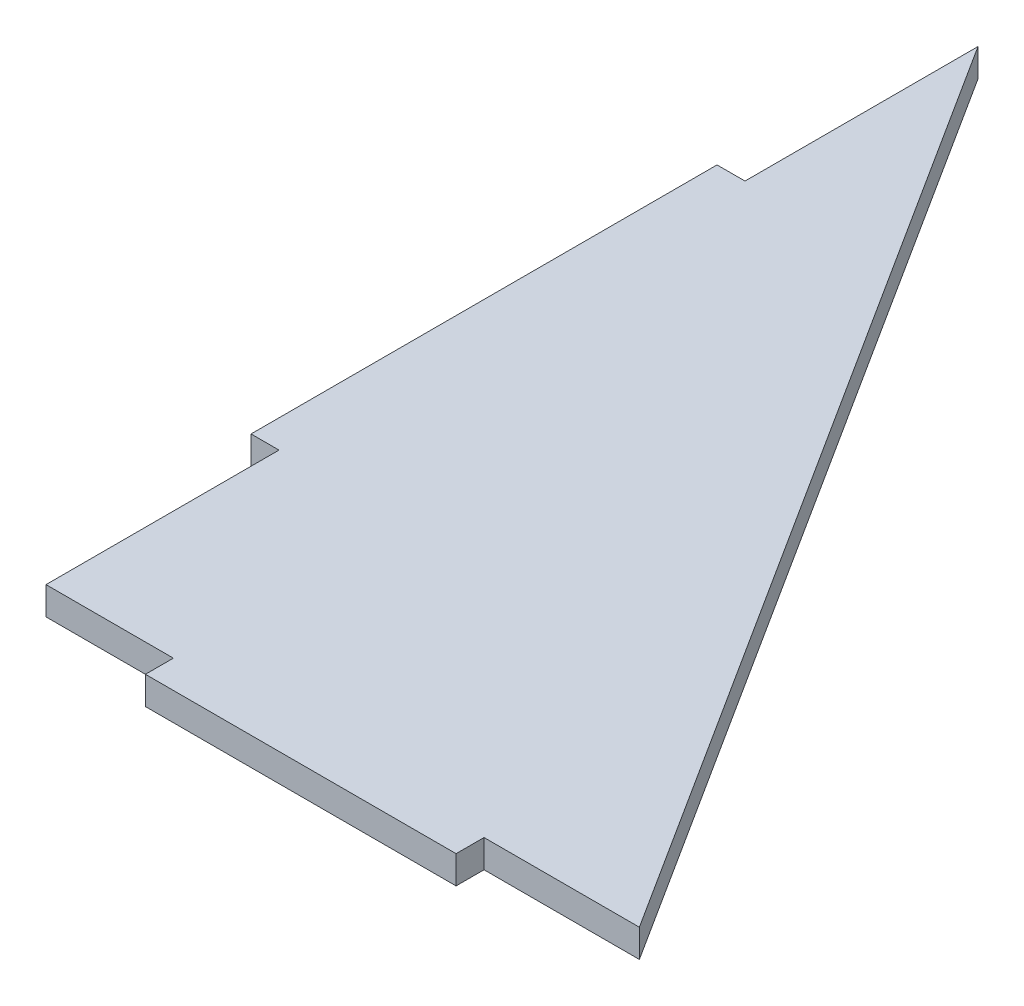
ISO-10303-21;
HEADER;
FILE_DESCRIPTION(('STEP AP214'),'2;1');
FILE_NAME('part.step','',(''),(''),'','','');
FILE_SCHEMA(('AUTOMOTIVE_DESIGN { 1 0 10303 214 1 1 1 1 }'));
ENDSEC;
DATA;
#1=APPLICATION_CONTEXT('core data for automotive mechanical design processes');
#2=APPLICATION_PROTOCOL_DEFINITION('international standard','automotive_design',2000,#1);
#3=PRODUCT_CONTEXT('',#1,'mechanical');
#4=PRODUCT('Part','Part','',(#3));
#5=PRODUCT_RELATED_PRODUCT_CATEGORY('part','',(#4));
#6=PRODUCT_DEFINITION_FORMATION('','',#4);
#7=PRODUCT_DEFINITION_CONTEXT('part definition',#1,'design');
#8=PRODUCT_DEFINITION('design','',#6,#7);
#9=PRODUCT_DEFINITION_SHAPE('','',#8);
#10=(LENGTH_UNIT() NAMED_UNIT(*) SI_UNIT(.MILLI.,.METRE.));
#11=(NAMED_UNIT(*) PLANE_ANGLE_UNIT() SI_UNIT($,.RADIAN.));
#12=(NAMED_UNIT(*) SI_UNIT($,.STERADIAN.) SOLID_ANGLE_UNIT());
#13=UNCERTAINTY_MEASURE_WITH_UNIT(LENGTH_MEASURE(1.E-05),#10,'distance_accuracy_value','');
#14=(GEOMETRIC_REPRESENTATION_CONTEXT(3) GLOBAL_UNCERTAINTY_ASSIGNED_CONTEXT((#13)) GLOBAL_UNIT_ASSIGNED_CONTEXT((#10,
#11,#12)) REPRESENTATION_CONTEXT('',''));
#15=CARTESIAN_POINT('',(0.,0.,0.));
#16=DIRECTION('',(0.,0.,1.));
#17=DIRECTION('',(1.,0.,0.));
#18=AXIS2_PLACEMENT_3D('',#15,#16,#17);
#19=CARTESIAN_POINT('',(0.,4.5,0.));
#20=DIRECTION('',(0.,0.,-1.));
#21=DIRECTION('',(-1.,0.,0.));
#22=AXIS2_PLACEMENT_3D('',#19,#20,#21);
#23=PLANE('',#22);
#24=DIRECTION('',(1.,0.,0.));
#25=VECTOR('',#24,1.);
#26=CARTESIAN_POINT('',(0.,0.,0.));
#27=LINE('',#26,#25);
#28=CARTESIAN_POINT('',(0.,0.,0.));
#29=VERTEX_POINT('',#28);
#30=CARTESIAN_POINT('',(20.5,0.,0.));
#31=VERTEX_POINT('',#30);
#32=EDGE_CURVE('E157',#29,#31,#27,.T.);
#33=ORIENTED_EDGE('',*,*,#32,.T.);
#34=DIRECTION('',(0.,-1.,0.));
#35=VECTOR('',#34,1.);
#36=CARTESIAN_POINT('',(20.5,4.5,0.));
#37=LINE('',#36,#35);
#38=CARTESIAN_POINT('',(20.5,4.5,0.));
#39=VERTEX_POINT('',#38);
#40=EDGE_CURVE('E11',#39,#31,#37,.T.);
#41=ORIENTED_EDGE('',*,*,#40,.F.);
#42=DIRECTION('',(1.,0.,0.));
#43=VECTOR('',#42,1.);
#44=CARTESIAN_POINT('',(0.,4.5,0.));
#45=LINE('',#44,#43);
#46=CARTESIAN_POINT('',(0.,4.5,0.));
#47=VERTEX_POINT('',#46);
#48=EDGE_CURVE('E215',#47,#39,#45,.T.);
#49=ORIENTED_EDGE('',*,*,#48,.F.);
#50=DIRECTION('',(0.,-1.,0.));
#51=VECTOR('',#50,1.);
#52=CARTESIAN_POINT('',(0.,4.5,0.));
#53=LINE('',#52,#51);
#54=EDGE_CURVE('E57',#47,#29,#53,.T.);
#55=ORIENTED_EDGE('',*,*,#54,.T.);
#56=EDGE_LOOP('',(#33,#41,#49,#55));
#57=FACE_BOUND('',#56,.T.);
#58=ADVANCED_FACE('F40',(#57),#23,.F.);
#59=CARTESIAN_POINT('',(20.5,4.5,0.));
#60=DIRECTION('',(1.,0.,0.));
#61=DIRECTION('',(0.,0.,-1.));
#62=AXIS2_PLACEMENT_3D('',#59,#60,#61);
#63=PLANE('',#62);
#64=DIRECTION('',(0.,0.,1.));
#65=VECTOR('',#64,1.);
#66=CARTESIAN_POINT('',(20.5,0.,0.));
#67=LINE('',#66,#65);
#68=CARTESIAN_POINT('',(20.5,0.,4.5));
#69=VERTEX_POINT('',#68);
#70=EDGE_CURVE('E159',#31,#69,#67,.T.);
#71=ORIENTED_EDGE('',*,*,#70,.T.);
#72=DIRECTION('',(0.,-1.,0.));
#73=VECTOR('',#72,1.);
#74=CARTESIAN_POINT('',(20.5,4.5,4.5));
#75=LINE('',#74,#73);
#76=CARTESIAN_POINT('',(20.5,4.5,4.5));
#77=VERTEX_POINT('',#76);
#78=EDGE_CURVE('E49',#77,#69,#75,.T.);
#79=ORIENTED_EDGE('',*,*,#78,.F.);
#80=DIRECTION('',(0.,0.,1.));
#81=VECTOR('',#80,1.);
#82=CARTESIAN_POINT('',(20.5,4.5,0.));
#83=LINE('',#82,#81);
#84=EDGE_CURVE('E105',#39,#77,#83,.T.);
#85=ORIENTED_EDGE('',*,*,#84,.F.);
#86=ORIENTED_EDGE('',*,*,#40,.T.);
#87=EDGE_LOOP('',(#71,#79,#85,#86));
#88=FACE_BOUND('',#87,.T.);
#89=ADVANCED_FACE('F42',(#88),#63,.F.);
#90=CARTESIAN_POINT('',(0.,4.5,4.5));
#91=DIRECTION('',(0.,0.,-1.));
#92=DIRECTION('',(-1.,0.,0.));
#93=AXIS2_PLACEMENT_3D('',#90,#91,#92);
#94=PLANE('',#93);
#95=DIRECTION('',(1.,0.,0.));
#96=VECTOR('',#95,1.);
#97=CARTESIAN_POINT('',(0.,0.,4.5));
#98=LINE('',#97,#96);
#99=CARTESIAN_POINT('',(70.5,0.,4.5));
#100=VERTEX_POINT('',#99);
#101=EDGE_CURVE('E162',#69,#100,#98,.T.);
#102=ORIENTED_EDGE('',*,*,#101,.T.);
#103=DIRECTION('',(0.,-1.,0.));
#104=VECTOR('',#103,1.);
#105=CARTESIAN_POINT('',(70.5,4.5,4.5));
#106=LINE('',#105,#104);
#107=CARTESIAN_POINT('',(70.5,4.5,4.5));
#108=VERTEX_POINT('',#107);
#109=EDGE_CURVE('E192',#108,#100,#106,.T.);
#110=ORIENTED_EDGE('',*,*,#109,.F.);
#111=DIRECTION('',(1.,0.,0.));
#112=VECTOR('',#111,1.);
#113=CARTESIAN_POINT('',(0.,4.5,4.5));
#114=LINE('',#113,#112);
#115=EDGE_CURVE('E199',#77,#108,#114,.T.);
#116=ORIENTED_EDGE('',*,*,#115,.F.);
#117=ORIENTED_EDGE('',*,*,#78,.T.);
#118=EDGE_LOOP('',(#102,#110,#116,#117));
#119=FACE_BOUND('',#118,.T.);
#120=ADVANCED_FACE('F197',(#119),#94,.F.);
#121=CARTESIAN_POINT('',(70.5,4.5,-1.0870933782788E-13));
#122=DIRECTION('',(1.,0.,0.));
#123=DIRECTION('',(0.,0.,-1.));
#124=AXIS2_PLACEMENT_3D('',#121,#122,#123);
#125=PLANE('',#124);
#126=DIRECTION('',(0.,0.,1.));
#127=VECTOR('',#126,1.);
#128=CARTESIAN_POINT('',(70.5,0.,-1.0870933782788E-13));
#129=LINE('',#128,#127);
#130=CARTESIAN_POINT('',(70.5,0.,0.));
#131=VERTEX_POINT('',#130);
#132=EDGE_CURVE('E165',#131,#100,#129,.T.);
#133=ORIENTED_EDGE('',*,*,#132,.F.);
#134=DIRECTION('',(0.,-1.,0.));
#135=VECTOR('',#134,1.);
#136=CARTESIAN_POINT('',(70.5,4.5,0.));
#137=LINE('',#136,#135);
#138=CARTESIAN_POINT('',(70.5,4.5,0.));
#139=VERTEX_POINT('',#138);
#140=EDGE_CURVE('E190',#139,#131,#137,.T.);
#141=ORIENTED_EDGE('',*,*,#140,.F.);
#142=DIRECTION('',(0.,0.,1.));
#143=VECTOR('',#142,1.);
#144=CARTESIAN_POINT('',(70.5,4.5,-1.0870933782788E-13));
#145=LINE('',#144,#143);
#146=EDGE_CURVE('E210',#139,#108,#145,.T.);
#147=ORIENTED_EDGE('',*,*,#146,.T.);
#148=ORIENTED_EDGE('',*,*,#109,.T.);
#149=EDGE_LOOP('',(#133,#141,#147,#148));
#150=FACE_BOUND('',#149,.T.);
#151=ADVANCED_FACE('F206',(#150),#125,.T.);
#152=CARTESIAN_POINT('',(95.5,0.,0.));
#153=VERTEX_POINT('',#152);
#154=EDGE_CURVE('E160',#131,#153,#27,.T.);
#155=ORIENTED_EDGE('',*,*,#154,.T.);
#156=DIRECTION('',(0.,-1.,0.));
#157=VECTOR('',#156,1.);
#158=CARTESIAN_POINT('',(95.5,4.5,0.));
#159=LINE('',#158,#157);
#160=CARTESIAN_POINT('',(95.5,4.5,0.));
#161=VERTEX_POINT('',#160);
#162=EDGE_CURVE('E188',#161,#153,#159,.T.);
#163=ORIENTED_EDGE('',*,*,#162,.F.);
#164=EDGE_CURVE('E211',#139,#161,#45,.T.);
#165=ORIENTED_EDGE('',*,*,#164,.F.);
#166=ORIENTED_EDGE('',*,*,#140,.T.);
#167=EDGE_LOOP('',(#155,#163,#165,#166));
#168=FACE_BOUND('',#167,.T.);
#169=ADVANCED_FACE('F233',(#168),#23,.F.);
#170=CARTESIAN_POINT('',(67.9548706920407,4.5,-43.2646010072659));
#171=DIRECTION('',(0.843545687333073,0.,-0.53705742093539));
#172=DIRECTION('',(-0.53705742093539,0.,-0.843545687333073));
#173=AXIS2_PLACEMENT_3D('',#170,#171,#172);
#174=PLANE('',#173);
#175=DIRECTION('',(0.53705742093539,0.,0.843545687333073));
#176=VECTOR('',#175,1.);
#177=CARTESIAN_POINT('',(67.9548706920407,0.,-43.2646010072659));
#178=LINE('',#177,#176);
#179=CARTESIAN_POINT('',(0.,0.,-150.));
#180=VERTEX_POINT('',#179);
#181=EDGE_CURVE('E168',#180,#153,#178,.T.);
#182=ORIENTED_EDGE('',*,*,#181,.F.);
#183=DIRECTION('',(0.,-1.,0.));
#184=VECTOR('',#183,1.);
#185=CARTESIAN_POINT('',(0.,4.5,-150.));
#186=LINE('',#185,#184);
#187=CARTESIAN_POINT('',(0.,4.5,-150.));
#188=VERTEX_POINT('',#187);
#189=EDGE_CURVE('E186',#188,#180,#186,.T.);
#190=ORIENTED_EDGE('',*,*,#189,.F.);
#191=DIRECTION('',(0.53705742093539,0.,0.843545687333073));
#192=VECTOR('',#191,1.);
#193=CARTESIAN_POINT('',(67.9548706920407,4.5,-43.2646010072659));
#194=LINE('',#193,#192);
#195=EDGE_CURVE('E213',#188,#161,#194,.T.);
#196=ORIENTED_EDGE('',*,*,#195,.T.);
#197=ORIENTED_EDGE('',*,*,#162,.T.);
#198=EDGE_LOOP('',(#182,#190,#196,#197));
#199=FACE_BOUND('',#198,.T.);
#200=ADVANCED_FACE('F239',(#199),#174,.T.);
#201=CARTESIAN_POINT('',(0.,4.5,0.));
#202=DIRECTION('',(-1.,0.,0.));
#203=DIRECTION('',(0.,0.,1.));
#204=AXIS2_PLACEMENT_3D('',#201,#202,#203);
#205=PLANE('',#204);
#206=DIRECTION('',(0.,0.,-1.));
#207=VECTOR('',#206,1.);
#208=CARTESIAN_POINT('',(0.,0.,0.));
#209=LINE('',#208,#207);
#210=CARTESIAN_POINT('',(0.,0.,-112.5));
#211=VERTEX_POINT('',#210);
#212=EDGE_CURVE('E171',#211,#180,#209,.T.);
#213=ORIENTED_EDGE('',*,*,#212,.F.);
#214=DIRECTION('',(0.,-1.,0.));
#215=VECTOR('',#214,1.);
#216=CARTESIAN_POINT('',(0.,4.5,-112.5));
#217=LINE('',#216,#215);
#218=CARTESIAN_POINT('',(0.,4.5,-112.5));
#219=VERTEX_POINT('',#218);
#220=EDGE_CURVE('E184',#219,#211,#217,.T.);
#221=ORIENTED_EDGE('',*,*,#220,.F.);
#222=DIRECTION('',(0.,0.,-1.));
#223=VECTOR('',#222,1.);
#224=CARTESIAN_POINT('',(0.,4.5,0.));
#225=LINE('',#224,#223);
#226=EDGE_CURVE('E154',#219,#188,#225,.T.);
#227=ORIENTED_EDGE('',*,*,#226,.T.);
#228=ORIENTED_EDGE('',*,*,#189,.T.);
#229=EDGE_LOOP('',(#213,#221,#227,#228));
#230=FACE_BOUND('',#229,.T.);
#231=ADVANCED_FACE('F245',(#230),#205,.T.);
#232=CARTESIAN_POINT('',(0.,4.5,-112.5));
#233=DIRECTION('',(0.,0.,-1.));
#234=DIRECTION('',(-1.,0.,0.));
#235=AXIS2_PLACEMENT_3D('',#232,#233,#234);
#236=PLANE('',#235);
#237=DIRECTION('',(1.,0.,0.));
#238=VECTOR('',#237,1.);
#239=CARTESIAN_POINT('',(0.,0.,-112.5));
#240=LINE('',#239,#238);
#241=CARTESIAN_POINT('',(-4.50000000000003,0.,-112.5));
#242=VERTEX_POINT('',#241);
#243=EDGE_CURVE('E174',#242,#211,#240,.T.);
#244=ORIENTED_EDGE('',*,*,#243,.F.);
#245=DIRECTION('',(0.,-1.,0.));
#246=VECTOR('',#245,1.);
#247=CARTESIAN_POINT('',(-4.50000000000003,4.5,-112.5));
#248=LINE('',#247,#246);
#249=CARTESIAN_POINT('',(-4.50000000000003,4.5,-112.5));
#250=VERTEX_POINT('',#249);
#251=EDGE_CURVE('E148',#250,#242,#248,.T.);
#252=ORIENTED_EDGE('',*,*,#251,.F.);
#253=DIRECTION('',(1.,0.,0.));
#254=VECTOR('',#253,1.);
#255=CARTESIAN_POINT('',(0.,4.5,-112.5));
#256=LINE('',#255,#254);
#257=EDGE_CURVE('E138',#250,#219,#256,.T.);
#258=ORIENTED_EDGE('',*,*,#257,.T.);
#259=ORIENTED_EDGE('',*,*,#220,.T.);
#260=EDGE_LOOP('',(#244,#252,#258,#259));
#261=FACE_BOUND('',#260,.T.);
#262=ADVANCED_FACE('F223',(#261),#236,.T.);
#263=CARTESIAN_POINT('',(-4.49999999999999,4.5,0.));
#264=DIRECTION('',(1.,0.,0.));
#265=DIRECTION('',(0.,0.,-1.));
#266=AXIS2_PLACEMENT_3D('',#263,#264,#265);
#267=PLANE('',#266);
#268=DIRECTION('',(0.,0.,1.));
#269=VECTOR('',#268,1.);
#270=CARTESIAN_POINT('',(-4.49999999999999,0.,0.));
#271=LINE('',#270,#269);
#272=CARTESIAN_POINT('',(-4.5,0.,-37.5));
#273=VERTEX_POINT('',#272);
#274=EDGE_CURVE('E145',#242,#273,#271,.T.);
#275=ORIENTED_EDGE('',*,*,#274,.T.);
#276=DIRECTION('',(0.,-1.,0.));
#277=VECTOR('',#276,1.);
#278=CARTESIAN_POINT('',(-4.5,4.5,-37.5));
#279=LINE('',#278,#277);
#280=CARTESIAN_POINT('',(-4.5,4.5,-37.5));
#281=VERTEX_POINT('',#280);
#282=EDGE_CURVE('E142',#281,#273,#279,.T.);
#283=ORIENTED_EDGE('',*,*,#282,.F.);
#284=DIRECTION('',(0.,0.,1.));
#285=VECTOR('',#284,1.);
#286=CARTESIAN_POINT('',(-4.49999999999999,4.5,0.));
#287=LINE('',#286,#285);
#288=EDGE_CURVE('E130',#250,#281,#287,.T.);
#289=ORIENTED_EDGE('',*,*,#288,.F.);
#290=ORIENTED_EDGE('',*,*,#251,.T.);
#291=EDGE_LOOP('',(#275,#283,#289,#290));
#292=FACE_BOUND('',#291,.T.);
#293=ADVANCED_FACE('F143',(#292),#267,.F.);
#294=CARTESIAN_POINT('',(0.,4.5,-37.5));
#295=DIRECTION('',(0.,0.,-1.));
#296=DIRECTION('',(-1.,0.,0.));
#297=AXIS2_PLACEMENT_3D('',#294,#295,#296);
#298=PLANE('',#297);
#299=DIRECTION('',(1.,0.,0.));
#300=VECTOR('',#299,1.);
#301=CARTESIAN_POINT('',(0.,0.,-37.5));
#302=LINE('',#301,#300);
#303=CARTESIAN_POINT('',(0.,0.,-37.5));
#304=VERTEX_POINT('',#303);
#305=EDGE_CURVE('E179',#273,#304,#302,.T.);
#306=ORIENTED_EDGE('',*,*,#305,.T.);
#307=DIRECTION('',(0.,-1.,0.));
#308=VECTOR('',#307,1.);
#309=CARTESIAN_POINT('',(0.,4.5,-37.5));
#310=LINE('',#309,#308);
#311=CARTESIAN_POINT('',(0.,4.5,-37.5));
#312=VERTEX_POINT('',#311);
#313=EDGE_CURVE('E93',#312,#304,#310,.T.);
#314=ORIENTED_EDGE('',*,*,#313,.F.);
#315=DIRECTION('',(1.,0.,0.));
#316=VECTOR('',#315,1.);
#317=CARTESIAN_POINT('',(0.,4.5,-37.5));
#318=LINE('',#317,#316);
#319=EDGE_CURVE('E135',#281,#312,#318,.T.);
#320=ORIENTED_EDGE('',*,*,#319,.F.);
#321=ORIENTED_EDGE('',*,*,#282,.T.);
#322=EDGE_LOOP('',(#306,#314,#320,#321));
#323=FACE_BOUND('',#322,.T.);
#324=ADVANCED_FACE('F150',(#323),#298,.F.);
#325=EDGE_CURVE('E175',#29,#304,#209,.T.);
#326=ORIENTED_EDGE('',*,*,#325,.F.);
#327=ORIENTED_EDGE('',*,*,#54,.F.);
#328=EDGE_CURVE('E151',#47,#312,#225,.T.);
#329=ORIENTED_EDGE('',*,*,#328,.T.);
#330=ORIENTED_EDGE('',*,*,#313,.T.);
#331=EDGE_LOOP('',(#326,#327,#329,#330));
#332=FACE_BOUND('',#331,.T.);
#333=ADVANCED_FACE('F253',(#332),#205,.T.);
#334=CARTESIAN_POINT('',(0.,4.5,0.));
#335=DIRECTION('',(0.,1.,0.));
#336=DIRECTION('',(0.,0.,1.));
#337=AXIS2_PLACEMENT_3D('',#334,#335,#336);
#338=PLANE('',#337);
#339=ORIENTED_EDGE('',*,*,#48,.T.);
#340=ORIENTED_EDGE('',*,*,#84,.T.);
#341=ORIENTED_EDGE('',*,*,#115,.T.);
#342=ORIENTED_EDGE('',*,*,#146,.F.);
#343=ORIENTED_EDGE('',*,*,#164,.T.);
#344=ORIENTED_EDGE('',*,*,#195,.F.);
#345=ORIENTED_EDGE('',*,*,#226,.F.);
#346=ORIENTED_EDGE('',*,*,#257,.F.);
#347=ORIENTED_EDGE('',*,*,#288,.T.);
#348=ORIENTED_EDGE('',*,*,#319,.T.);
#349=ORIENTED_EDGE('',*,*,#328,.F.);
#350=EDGE_LOOP('',(#339,#340,#341,#342,#343,#344,#345,#346,#347,#348,#349));
#351=FACE_BOUND('',#350,.T.);
#352=ADVANCED_FACE('F132',(#351),#338,.T.);
#353=CARTESIAN_POINT('',(0.,0.,0.));
#354=DIRECTION('',(0.,1.,0.));
#355=DIRECTION('',(0.,0.,1.));
#356=AXIS2_PLACEMENT_3D('',#353,#354,#355);
#357=PLANE('',#356);
#358=ORIENTED_EDGE('',*,*,#32,.F.);
#359=ORIENTED_EDGE('',*,*,#325,.T.);
#360=ORIENTED_EDGE('',*,*,#305,.F.);
#361=ORIENTED_EDGE('',*,*,#274,.F.);
#362=ORIENTED_EDGE('',*,*,#243,.T.);
#363=ORIENTED_EDGE('',*,*,#212,.T.);
#364=ORIENTED_EDGE('',*,*,#181,.T.);
#365=ORIENTED_EDGE('',*,*,#154,.F.);
#366=ORIENTED_EDGE('',*,*,#132,.T.);
#367=ORIENTED_EDGE('',*,*,#101,.F.);
#368=ORIENTED_EDGE('',*,*,#70,.F.);
#369=EDGE_LOOP('',(#358,#359,#360,#361,#362,#363,#364,#365,#366,#367,#368));
#370=FACE_BOUND('',#369,.T.);
#371=ADVANCED_FACE('F201',(#370),#357,.F.);
#372=CLOSED_SHELL('',(#58,#89,#120,#151,#169,#200,#231,#262,#293,#324,#333,#352,#371));
#373=MANIFOLD_SOLID_BREP('B2',#372);
#374=ADVANCED_BREP_SHAPE_REPRESENTATION('',(#18,#373),#14);
#375=SHAPE_DEFINITION_REPRESENTATION(#9,#374);
ENDSEC;
END-ISO-10303-21;
